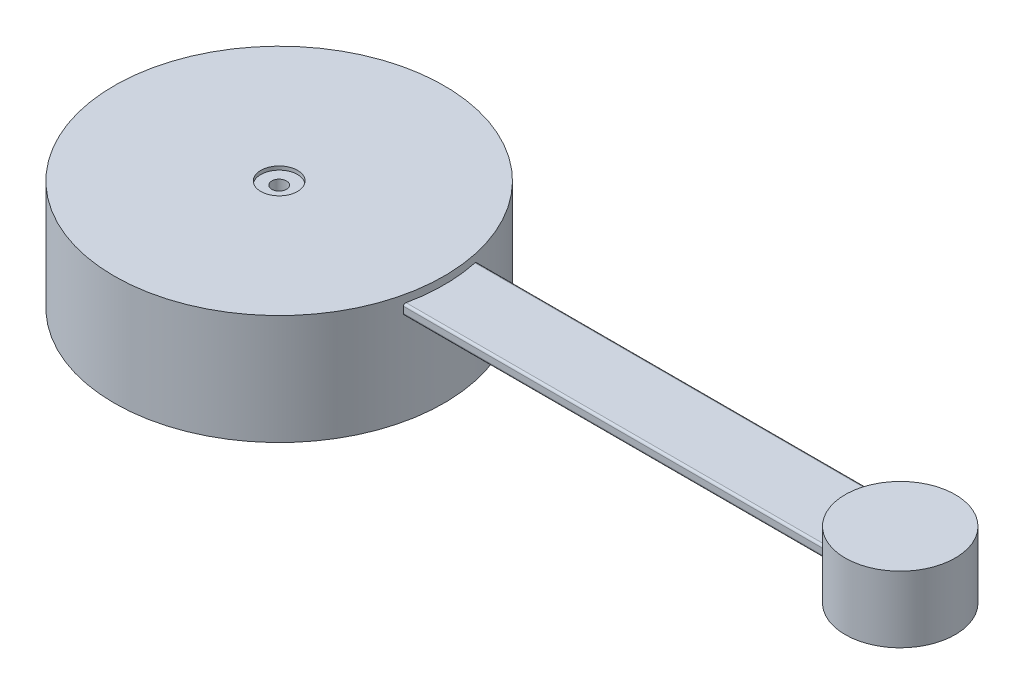
ISO-10303-21;
HEADER;
FILE_DESCRIPTION(('STEP AP214'),'2;1');
FILE_NAME('part.step','',(''),(''),'','','');
FILE_SCHEMA(('AUTOMOTIVE_DESIGN { 1 0 10303 214 1 1 1 1 }'));
ENDSEC;
DATA;
#1=APPLICATION_CONTEXT('core data for automotive mechanical design processes');
#2=APPLICATION_PROTOCOL_DEFINITION('international standard','automotive_design',2000,#1);
#3=PRODUCT_CONTEXT('',#1,'mechanical');
#4=PRODUCT('Part','Part','',(#3));
#5=PRODUCT_RELATED_PRODUCT_CATEGORY('part','',(#4));
#6=PRODUCT_DEFINITION_FORMATION('','',#4);
#7=PRODUCT_DEFINITION_CONTEXT('part definition',#1,'design');
#8=PRODUCT_DEFINITION('design','',#6,#7);
#9=PRODUCT_DEFINITION_SHAPE('','',#8);
#10=(LENGTH_UNIT() NAMED_UNIT(*) SI_UNIT(.MILLI.,.METRE.));
#11=(NAMED_UNIT(*) PLANE_ANGLE_UNIT() SI_UNIT($,.RADIAN.));
#12=(NAMED_UNIT(*) SI_UNIT($,.STERADIAN.) SOLID_ANGLE_UNIT());
#13=UNCERTAINTY_MEASURE_WITH_UNIT(LENGTH_MEASURE(1.E-05),#10,'distance_accuracy_value','');
#14=(GEOMETRIC_REPRESENTATION_CONTEXT(3) GLOBAL_UNCERTAINTY_ASSIGNED_CONTEXT((#13)) GLOBAL_UNIT_ASSIGNED_CONTEXT((#10,
#11,#12)) REPRESENTATION_CONTEXT('',''));
#15=CARTESIAN_POINT('',(0.,0.,0.));
#16=DIRECTION('',(0.,0.,1.));
#17=DIRECTION('',(1.,0.,0.));
#18=AXIS2_PLACEMENT_3D('',#15,#16,#17);
#19=CARTESIAN_POINT('',(-22.502,5.02974163039778,5.));
#20=DIRECTION('',(0.,0.,1.));
#21=DIRECTION('',(1.,0.,0.));
#22=AXIS2_PLACEMENT_3D('',#19,#20,#21);
#23=PLANE('',#22);
#24=DIRECTION('',(0.,-1.,0.));
#25=VECTOR('',#24,1.);
#26=CARTESIAN_POINT('',(21.9374109684803,7.5,5.));
#27=LINE('',#26,#25);
#28=CARTESIAN_POINT('',(21.9374109684803,6.16643646538342,5.));
#29=VERTEX_POINT('',#28);
#30=CARTESIAN_POINT('',(21.9374109684803,5.32974163039778,5.));
#31=VERTEX_POINT('',#30);
#32=EDGE_CURVE('E151',#29,#31,#27,.T.);
#33=ORIENTED_EDGE('',*,*,#32,.T.);
#34=DIRECTION('',(1.,0.,0.));
#35=VECTOR('',#34,1.);
#36=CARTESIAN_POINT('',(-22.502,5.32974163039778,5.));
#37=LINE('',#36,#35);
#38=CARTESIAN_POINT('',(79.1098300562505,5.32974163039777,5.));
#39=VERTEX_POINT('',#38);
#40=EDGE_CURVE('E122',#31,#39,#37,.T.);
#41=ORIENTED_EDGE('',*,*,#40,.T.);
#42=DIRECTION('',(0.,-1.,0.));
#43=VECTOR('',#42,1.);
#44=CARTESIAN_POINT('',(79.1098300562505,15.,5.));
#45=LINE('',#44,#43);
#46=CARTESIAN_POINT('',(79.1098300562505,6.16643646538342,5.));
#47=VERTEX_POINT('',#46);
#48=EDGE_CURVE('E139',#39,#47,#45,.F.);
#49=ORIENTED_EDGE('',*,*,#48,.T.);
#50=DIRECTION('',(1.,0.,0.));
#51=VECTOR('',#50,1.);
#52=CARTESIAN_POINT('',(-22.502,6.16643646538342,5.));
#53=LINE('',#52,#51);
#54=EDGE_CURVE('E67',#47,#29,#53,.F.);
#55=ORIENTED_EDGE('',*,*,#54,.T.);
#56=EDGE_LOOP('',(#33,#41,#49,#55));
#57=FACE_BOUND('',#56,.T.);
#58=ADVANCED_FACE('F39',(#57),#23,.T.);
#59=CARTESIAN_POINT('',(-22.502,5.02974163039778,-5.));
#60=DIRECTION('',(0.,0.,-1.));
#61=DIRECTION('',(-1.,0.,0.));
#62=AXIS2_PLACEMENT_3D('',#59,#60,#61);
#63=PLANE('',#62);
#64=DIRECTION('',(0.,-1.,0.));
#65=VECTOR('',#64,1.);
#66=CARTESIAN_POINT('',(79.1098300562505,15.,-5.));
#67=LINE('',#66,#65);
#68=CARTESIAN_POINT('',(79.1098300562505,6.16643646538343,-5.));
#69=VERTEX_POINT('',#68);
#70=CARTESIAN_POINT('',(79.1098300562505,5.32974163039778,-5.));
#71=VERTEX_POINT('',#70);
#72=EDGE_CURVE('E144',#69,#71,#67,.T.);
#73=ORIENTED_EDGE('',*,*,#72,.T.);
#74=DIRECTION('',(1.,0.,0.));
#75=VECTOR('',#74,1.);
#76=CARTESIAN_POINT('',(-22.502,5.32974163039778,-5.));
#77=LINE('',#76,#75);
#78=CARTESIAN_POINT('',(21.9374109684803,5.32974163039778,-5.));
#79=VERTEX_POINT('',#78);
#80=EDGE_CURVE('E116',#71,#79,#77,.F.);
#81=ORIENTED_EDGE('',*,*,#80,.T.);
#82=DIRECTION('',(0.,-1.,0.));
#83=VECTOR('',#82,1.);
#84=CARTESIAN_POINT('',(21.9374109684803,7.5,-5.));
#85=LINE('',#84,#83);
#86=CARTESIAN_POINT('',(21.9374109684803,6.16643646538343,-5.));
#87=VERTEX_POINT('',#86);
#88=EDGE_CURVE('E142',#79,#87,#85,.F.);
#89=ORIENTED_EDGE('',*,*,#88,.T.);
#90=DIRECTION('',(1.,0.,0.));
#91=VECTOR('',#90,1.);
#92=CARTESIAN_POINT('',(-22.502,6.16643646538343,-5.));
#93=LINE('',#92,#91);
#94=EDGE_CURVE('E131',#87,#69,#93,.T.);
#95=ORIENTED_EDGE('',*,*,#94,.T.);
#96=EDGE_LOOP('',(#73,#81,#89,#95));
#97=FACE_BOUND('',#96,.T.);
#98=ADVANCED_FACE('F242',(#97),#63,.T.);
#99=CARTESIAN_POINT('',(0.,7.5,0.));
#100=DIRECTION('',(0.,-1.,0.));
#101=DIRECTION('',(0.,0.,-1.));
#102=AXIS2_PLACEMENT_3D('',#99,#100,#101);
#103=CYLINDRICAL_SURFACE('',#102,22.5);
#104=ORIENTED_EDGE('',*,*,#88,.F.);
#105=CARTESIAN_POINT('',(21.9374109684803,5.32974163039778,-5.));
#106=CARTESIAN_POINT('',(21.937406865348,5.31316354075174,-5.00001565178497));
#107=CARTESIAN_POINT('',(21.9377239334269,5.29659236692933,-4.99862684241301));
#108=CARTESIAN_POINT('',(21.9389693939826,5.26394837265453,-4.99315891772323));
#109=CARTESIAN_POINT('',(21.9398968605122,5.24787483591722,-4.98908387728288));
#110=CARTESIAN_POINT('',(21.9423325415707,5.21665420645818,-4.97836026362395));
#111=CARTESIAN_POINT('',(21.9438408851947,5.20150732054441,-4.97171111833097));
#112=CARTESIAN_POINT('',(21.9473825394913,5.17255568574754,-4.95605329721319));
#113=CARTESIAN_POINT('',(21.94941586728,5.15875098064376,-4.94704454445796));
#114=CARTESIAN_POINT('',(21.9539634249717,5.13269924290083,-4.92682433880949));
#115=CARTESIAN_POINT('',(21.9564827917378,5.12047141281788,-4.9155893189827));
#116=CARTESIAN_POINT('',(21.9619043244392,5.09806628274106,-4.89130994192386));
#117=CARTESIAN_POINT('',(21.9648065824029,5.08788947720567,-4.87826514967078));
#118=CARTESIAN_POINT('',(21.9709750522913,5.06962392161329,-4.85040856496719));
#119=CARTESIAN_POINT('',(21.9742482291966,5.06159002849504,-4.83556237676449));
#120=CARTESIAN_POINT('',(21.981000227255,5.04813215916057,-4.80477647269883));
#121=CARTESIAN_POINT('',(21.9844789897746,5.04270744279827,-4.78883706841653));
#122=CARTESIAN_POINT('',(21.9905852037846,5.03569269865328,-4.76070477255301));
#123=CARTESIAN_POINT('',(21.9931889745046,5.03346282589828,-4.74866198788495));
#124=CARTESIAN_POINT('',(21.9984103799019,5.03048725864101,-4.7244149270426));
#125=CARTESIAN_POINT('',(22.0010279907442,5.0297395382112,-4.71221089429226));
#126=CARTESIAN_POINT('',(22.0036360631601,5.02974163039778,-4.7));
#127=B_SPLINE_CURVE_WITH_KNOTS('',3,(#105,#106,#107,#108,#109,#110,#111,#112,#113,#114,#115,
#116,#117,#118,#119,#120,#121,#122,#123,#124,#125,#126),.UNSPECIFIED.,.F.,.F.,(4,2,2,2,2,2,2,2,
2,2,4),(0.,0.0496627691444595,0.0992503751973924,0.148849008035062,0.198449258141109,
0.248605694190537,0.298774207466198,0.350124954211031,0.401461125667854,0.438939881917801,
0.476367373702138),.UNSPECIFIED.);
#128=CARTESIAN_POINT('',(22.0036360631601,5.02974163039778,-4.7));
#129=VERTEX_POINT('',#128);
#130=EDGE_CURVE('E121',#79,#129,#127,.T.);
#131=ORIENTED_EDGE('',*,*,#130,.T.);
#132=CARTESIAN_POINT('',(0.,5.02974163039778,0.));
#133=DIRECTION('',(0.,-1.,0.));
#134=DIRECTION('',(0.,0.,-1.));
#135=AXIS2_PLACEMENT_3D('',#132,#133,#134);
#136=CIRCLE('',#135,22.5);
#137=CARTESIAN_POINT('',(22.0036360631601,5.02974163039778,4.7));
#138=VERTEX_POINT('',#137);
#139=EDGE_CURVE('E130',#138,#129,#136,.F.);
#140=ORIENTED_EDGE('',*,*,#139,.F.);
#141=CARTESIAN_POINT('',(22.0036360631601,5.02974163039778,4.7));
#142=CARTESIAN_POINT('',(21.9999650754254,5.02972882581572,4.71718998797957));
#143=CARTESIAN_POINT('',(21.9962729849371,5.03121837926234,4.73437266595167));
#144=CARTESIAN_POINT('',(21.9889548978668,5.03710519846554,4.7682442421456));
#145=CARTESIAN_POINT('',(21.9853288901985,5.04150197179176,4.78493322349063));
#146=CARTESIAN_POINT('',(21.9782476781734,5.05311001549823,4.8173548017975));
#147=CARTESIAN_POINT('',(21.9747925850396,5.06032309213485,4.83308677747765));
#148=CARTESIAN_POINT('',(21.9681658331569,5.07737269398329,4.8631189473594));
#149=CARTESIAN_POINT('',(21.9649940807403,5.08720834789813,4.8774196149172));
#150=CARTESIAN_POINT('',(21.9590670953692,5.10914147554456,4.90403476586607));
#151=CARTESIAN_POINT('',(21.9563082360852,5.12121687869912,4.91636661393081));
#152=CARTESIAN_POINT('',(21.9512682996128,5.14736454949226,4.93882099270274));
#153=CARTESIAN_POINT('',(21.9489872856333,5.16143708089624,4.94894323113269));
#154=CARTESIAN_POINT('',(21.9450336634162,5.19084095598946,4.96644505930458));
#155=CARTESIAN_POINT('',(21.9433486582224,5.20613736457608,4.9738806128787));
#156=CARTESIAN_POINT('',(21.9405823846822,5.23780834566935,4.98606899680203));
#157=CARTESIAN_POINT('',(21.9395005435971,5.25418187880738,4.99082437217992));
#158=CARTESIAN_POINT('',(21.938299111856,5.28053206900157,4.99610206695527));
#159=CARTESIAN_POINT('',(21.9379663159859,5.29032074216175,4.99756296178367));
#160=CARTESIAN_POINT('',(21.9375222847446,5.30998522405526,4.99951161303384));
#161=CARTESIAN_POINT('',(21.9374107322678,5.31986088766947,5.00000076224911));
#162=CARTESIAN_POINT('',(21.9374109684803,5.32974163039771,5.00000000000034));
#163=B_SPLINE_CURVE_WITH_KNOTS('',3,(#141,#142,#143,#144,#145,#146,#147,#148,#149,#150,#151,
#152,#153,#154,#155,#156,#157,#158,#159,#160,#161,#162),.UNSPECIFIED.,.F.,.F.,(4,2,2,2,2,2,2,2,
2,2,4),(0.,0.0526662949181202,0.105323671404695,0.15801487570059,0.210688596199799,
0.26286846709763,0.315055235937837,0.366081963749873,0.417060155896441,0.446722272435618,
0.476341843791279),.UNSPECIFIED.);
#164=EDGE_CURVE('E60',#138,#31,#163,.T.);
#165=ORIENTED_EDGE('',*,*,#164,.T.);
#166=ORIENTED_EDGE('',*,*,#32,.F.);
#167=CARTESIAN_POINT('',(21.9374109684803,6.16643646538342,5.));
#168=CARTESIAN_POINT('',(21.937406865348,6.18301455502947,5.00001565178497));
#169=CARTESIAN_POINT('',(21.9377239334269,6.19958572885187,4.99862684241301));
#170=CARTESIAN_POINT('',(21.9389693939826,6.23222972312667,4.99315891772324));
#171=CARTESIAN_POINT('',(21.9398968605122,6.24830325986398,4.98908387728289));
#172=CARTESIAN_POINT('',(21.9423325415707,6.27952388932302,4.97836026362396));
#173=CARTESIAN_POINT('',(21.9438408851947,6.29467077523679,4.97171111833098));
#174=CARTESIAN_POINT('',(21.9473825394913,6.32362241003366,4.95605329721319));
#175=CARTESIAN_POINT('',(21.94941586728,6.33742711513744,4.94704454445797));
#176=CARTESIAN_POINT('',(21.9539634249717,6.36347885288038,4.92682433880949));
#177=CARTESIAN_POINT('',(21.9564827917378,6.37570668296332,4.9155893189827));
#178=CARTESIAN_POINT('',(21.9619043244392,6.39811181304014,4.89130994192386));
#179=CARTESIAN_POINT('',(21.9648065824029,6.40828861857553,4.87826514967078));
#180=CARTESIAN_POINT('',(21.9709750522913,6.42655417416791,4.85040856496719));
#181=CARTESIAN_POINT('',(21.9742482291966,6.43458806728617,4.83556237676449));
#182=CARTESIAN_POINT('',(21.981000227255,6.44804593662063,4.80477647269883));
#183=CARTESIAN_POINT('',(21.9844789897746,6.45347065298293,4.78883706841653));
#184=CARTESIAN_POINT('',(21.9905852037846,6.46048539712792,4.76070477255301));
#185=CARTESIAN_POINT('',(21.9931889745046,6.46271526988292,4.74866198788496));
#186=CARTESIAN_POINT('',(21.9984103799019,6.4656908371402,4.7244149270426));
#187=CARTESIAN_POINT('',(22.0010279907442,6.46643855757,4.71221089429226));
#188=CARTESIAN_POINT('',(22.0036360631601,6.46643646538342,4.7));
#189=B_SPLINE_CURVE_WITH_KNOTS('',3,(#167,#168,#169,#170,#171,#172,#173,#174,#175,#176,#177,
#178,#179,#180,#181,#182,#183,#184,#185,#186,#187,#188),.UNSPECIFIED.,.F.,.F.,(4,2,2,2,2,2,2,2,
2,2,4),(0.,0.0496627691444586,0.0992503751973925,0.148849008035061,0.198449258141109,
0.248605694190537,0.298774207466198,0.350124954211031,0.401461125667854,0.438939881917801,
0.476367373702139),.UNSPECIFIED.);
#190=CARTESIAN_POINT('',(22.0036360631601,6.46643646538342,4.7));
#191=VERTEX_POINT('',#190);
#192=EDGE_CURVE('E11',#29,#191,#189,.T.);
#193=ORIENTED_EDGE('',*,*,#192,.T.);
#194=CARTESIAN_POINT('',(0.,6.46643646538342,0.));
#195=DIRECTION('',(0.,1.,0.));
#196=DIRECTION('',(0.,0.,1.));
#197=AXIS2_PLACEMENT_3D('',#194,#195,#196);
#198=CIRCLE('',#197,22.5);
#199=CARTESIAN_POINT('',(22.0036360631601,6.46643646538342,-4.7));
#200=VERTEX_POINT('',#199);
#201=EDGE_CURVE('E138',#200,#191,#198,.F.);
#202=ORIENTED_EDGE('',*,*,#201,.F.);
#203=CARTESIAN_POINT('',(22.0036360631601,6.46643646538342,-4.7));
#204=CARTESIAN_POINT('',(21.9999650754254,6.46644926996548,-4.71718998797957));
#205=CARTESIAN_POINT('',(21.9962729849371,6.46495971651886,-4.73437266595167));
#206=CARTESIAN_POINT('',(21.9889548978668,6.45907289731566,-4.7682442421456));
#207=CARTESIAN_POINT('',(21.9853288901985,6.45467612398944,-4.78493322349062));
#208=CARTESIAN_POINT('',(21.9782476781734,6.44306808028296,-4.8173548017975));
#209=CARTESIAN_POINT('',(21.9747925850396,6.43585500364635,-4.83308677747765));
#210=CARTESIAN_POINT('',(21.9681658331569,6.41880540179791,-4.86311894735939));
#211=CARTESIAN_POINT('',(21.9649940807403,6.40896974788307,-4.8774196149172));
#212=CARTESIAN_POINT('',(21.9590670953692,6.38703662023664,-4.90403476586607));
#213=CARTESIAN_POINT('',(21.9563082360852,6.37496121708208,-4.91636661393081));
#214=CARTESIAN_POINT('',(21.9512682996128,6.34881354628894,-4.93882099270274));
#215=CARTESIAN_POINT('',(21.9489872856333,6.33474101488496,-4.94894323113269));
#216=CARTESIAN_POINT('',(21.9450336634162,6.30533713979174,-4.96644505930457));
#217=CARTESIAN_POINT('',(21.9433486582224,6.29004073120512,-4.9738806128787));
#218=CARTESIAN_POINT('',(21.9405823846822,6.25836975011185,-4.98606899680203));
#219=CARTESIAN_POINT('',(21.9395005435971,6.24199621697383,-4.99082437217992));
#220=CARTESIAN_POINT('',(21.938299111856,6.21564602677964,-4.99610206695527));
#221=CARTESIAN_POINT('',(21.9379663159859,6.20585735361945,-4.99756296178367));
#222=CARTESIAN_POINT('',(21.9375222847446,6.18619287172594,-4.99951161303384));
#223=CARTESIAN_POINT('',(21.9374107322678,6.17631720811173,-5.00000076224911));
#224=CARTESIAN_POINT('',(21.9374109684803,6.16643646538349,-5.00000000000034));
#225=B_SPLINE_CURVE_WITH_KNOTS('',3,(#203,#204,#205,#206,#207,#208,#209,#210,#211,#212,#213,
#214,#215,#216,#217,#218,#219,#220,#221,#222,#223,#224),.UNSPECIFIED.,.F.,.F.,(4,2,2,2,2,2,2,2,
2,2,4),(0.,0.0526662949181202,0.105323671404695,0.15801487570059,0.210688596199799,
0.26286846709763,0.315055235937837,0.366081963749873,0.417060155896441,0.446722272435617,
0.476341843791279),.UNSPECIFIED.);
#226=EDGE_CURVE('E209',#200,#87,#225,.T.);
#227=ORIENTED_EDGE('',*,*,#226,.T.);
#228=EDGE_LOOP('',(#104,#131,#140,#165,#166,#193,#202,#227));
#229=FACE_BOUND('',#228,.T.);
#230=CARTESIAN_POINT('',(0.,7.5,0.));
#231=DIRECTION('',(0.,1.,0.));
#232=DIRECTION('',(0.,0.,1.));
#233=AXIS2_PLACEMENT_3D('',#230,#231,#232);
#234=CIRCLE('',#233,22.5);
#235=CARTESIAN_POINT('',(0.,7.5,22.5));
#236=VERTEX_POINT('',#235);
#237=EDGE_CURVE('E154',#236,#236,#234,.T.);
#238=ORIENTED_EDGE('',*,*,#237,.F.);
#239=EDGE_LOOP('',(#238));
#240=FACE_BOUND('',#239,.T.);
#241=CARTESIAN_POINT('',(0.,-7.5,0.));
#242=DIRECTION('',(0.,1.,0.));
#243=DIRECTION('',(0.,0.,1.));
#244=AXIS2_PLACEMENT_3D('',#241,#242,#243);
#245=CIRCLE('',#244,22.5);
#246=CARTESIAN_POINT('',(0.,-7.5,22.5));
#247=VERTEX_POINT('',#246);
#248=EDGE_CURVE('E153',#247,#247,#245,.T.);
#249=ORIENTED_EDGE('',*,*,#248,.T.);
#250=EDGE_LOOP('',(#249));
#251=FACE_BOUND('',#250,.T.);
#252=ADVANCED_FACE('F193',(#229,#240,#251),#103,.T.);
#253=CARTESIAN_POINT('',(0.,7.5,0.));
#254=DIRECTION('',(0.,1.,0.));
#255=DIRECTION('',(0.,0.,1.));
#256=AXIS2_PLACEMENT_3D('',#253,#254,#255);
#257=PLANE('',#256);
#258=CARTESIAN_POINT('',(0.,7.5,0.));
#259=DIRECTION('',(0.,1.,0.));
#260=DIRECTION('',(0.,0.,1.));
#261=AXIS2_PLACEMENT_3D('',#258,#259,#260);
#262=CIRCLE('',#261,2.5);
#263=CARTESIAN_POINT('',(0.,7.5,2.5));
#264=VERTEX_POINT('',#263);
#265=EDGE_CURVE('E251',#264,#264,#262,.T.);
#266=ORIENTED_EDGE('',*,*,#265,.F.);
#267=EDGE_LOOP('',(#266));
#268=FACE_BOUND('',#267,.T.);
#269=ORIENTED_EDGE('',*,*,#237,.T.);
#270=EDGE_LOOP('',(#269));
#271=FACE_BOUND('',#270,.T.);
#272=ADVANCED_FACE('F283',(#268,#271),#257,.T.);
#273=CARTESIAN_POINT('',(0.,-7.5,0.));
#274=DIRECTION('',(0.,1.,0.));
#275=DIRECTION('',(0.,0.,1.));
#276=AXIS2_PLACEMENT_3D('',#273,#274,#275);
#277=PLANE('',#276);
#278=ORIENTED_EDGE('',*,*,#248,.F.);
#279=EDGE_LOOP('',(#278));
#280=FACE_BOUND('',#279,.T.);
#281=ADVANCED_FACE('F286',(#280),#277,.F.);
#282=CARTESIAN_POINT('',(-22.502,5.02974163039778,-5.));
#283=DIRECTION('',(0.,-1.,0.));
#284=DIRECTION('',(0.,0.,-1.));
#285=AXIS2_PLACEMENT_3D('',#282,#283,#284);
#286=PLANE('',#285);
#287=ORIENTED_EDGE('',*,*,#139,.T.);
#288=DIRECTION('',(1.,0.,0.));
#289=VECTOR('',#288,1.);
#290=CARTESIAN_POINT('',(-22.502,5.02974163039778,-4.7));
#291=LINE('',#290,#289);
#292=CARTESIAN_POINT('',(78.855344321519,5.02974163039778,-4.7));
#293=VERTEX_POINT('',#292);
#294=EDGE_CURVE('E115',#129,#293,#291,.T.);
#295=ORIENTED_EDGE('',*,*,#294,.T.);
#296=CARTESIAN_POINT('',(84.7,5.02974163039778,0.));
#297=DIRECTION('',(0.,-1.,0.));
#298=DIRECTION('',(0.,0.,-1.));
#299=AXIS2_PLACEMENT_3D('',#296,#297,#298);
#300=CIRCLE('',#299,7.5);
#301=CARTESIAN_POINT('',(78.855344321519,5.02974163039778,4.7));
#302=VERTEX_POINT('',#301);
#303=EDGE_CURVE('E128',#293,#302,#300,.F.);
#304=ORIENTED_EDGE('',*,*,#303,.T.);
#305=DIRECTION('',(1.,0.,0.));
#306=VECTOR('',#305,1.);
#307=CARTESIAN_POINT('',(-22.502,5.02974163039778,4.7));
#308=LINE('',#307,#306);
#309=EDGE_CURVE('E132',#302,#138,#308,.F.);
#310=ORIENTED_EDGE('',*,*,#309,.T.);
#311=EDGE_LOOP('',(#287,#295,#304,#310));
#312=FACE_BOUND('',#311,.T.);
#313=ADVANCED_FACE('F127',(#312),#286,.T.);
#314=CARTESIAN_POINT('',(-22.502,6.46643646538342,-5.));
#315=DIRECTION('',(0.,1.,0.));
#316=DIRECTION('',(0.,0.,1.));
#317=AXIS2_PLACEMENT_3D('',#314,#315,#316);
#318=PLANE('',#317);
#319=CARTESIAN_POINT('',(84.7,6.46643646538342,0.));
#320=DIRECTION('',(0.,1.,0.));
#321=DIRECTION('',(0.,0.,1.));
#322=AXIS2_PLACEMENT_3D('',#319,#320,#321);
#323=CIRCLE('',#322,7.5);
#324=CARTESIAN_POINT('',(78.855344321519,6.46643646538342,4.7));
#325=VERTEX_POINT('',#324);
#326=CARTESIAN_POINT('',(78.855344321519,6.46643646538342,-4.7));
#327=VERTEX_POINT('',#326);
#328=EDGE_CURVE('E157',#325,#327,#323,.F.);
#329=ORIENTED_EDGE('',*,*,#328,.T.);
#330=DIRECTION('',(1.,0.,0.));
#331=VECTOR('',#330,1.);
#332=CARTESIAN_POINT('',(-22.502,6.46643646538342,-4.7));
#333=LINE('',#332,#331);
#334=EDGE_CURVE('E169',#327,#200,#333,.F.);
#335=ORIENTED_EDGE('',*,*,#334,.T.);
#336=ORIENTED_EDGE('',*,*,#201,.T.);
#337=DIRECTION('',(1.,0.,0.));
#338=VECTOR('',#337,1.);
#339=CARTESIAN_POINT('',(-22.502,6.46643646538342,4.7));
#340=LINE('',#339,#338);
#341=EDGE_CURVE('E166',#191,#325,#340,.T.);
#342=ORIENTED_EDGE('',*,*,#341,.T.);
#343=EDGE_LOOP('',(#329,#335,#336,#342));
#344=FACE_BOUND('',#343,.T.);
#345=ADVANCED_FACE('F238',(#344),#318,.T.);
#346=CARTESIAN_POINT('',(84.7,15.,0.));
#347=DIRECTION('',(0.,-1.,0.));
#348=DIRECTION('',(0.,0.,-1.));
#349=AXIS2_PLACEMENT_3D('',#346,#347,#348);
#350=CYLINDRICAL_SURFACE('',#349,7.5);
#351=ORIENTED_EDGE('',*,*,#303,.F.);
#352=CARTESIAN_POINT('',(78.855344321519,5.02974163039778,-4.7));
#353=CARTESIAN_POINT('',(78.8712030380244,5.02975771418991,-4.71972827815664));
#354=CARTESIAN_POINT('',(78.8871817418711,5.03168929316465,-4.73938698076376));
#355=CARTESIAN_POINT('',(78.9190493434537,5.03942961975224,-4.77820316346192));
#356=CARTESIAN_POINT('',(78.9349371033589,5.0452618845292,-4.79735686645343));
#357=CARTESIAN_POINT('',(78.9647394939133,5.06017466709663,-4.83293726870535));
#358=CARTESIAN_POINT('',(78.9787057844008,5.06892980847668,-4.8494564351266));
#359=CARTESIAN_POINT('',(79.0056602267922,5.08980702670581,-4.88107801322704));
#360=CARTESIAN_POINT('',(79.0186505621718,5.10192128480559,-4.89618360726265));
#361=CARTESIAN_POINT('',(79.0400719003135,5.12622536803336,-4.92091594348356));
#362=CARTESIAN_POINT('',(79.0488410522481,5.13767238260289,-4.93097920390164));
#363=CARTESIAN_POINT('',(79.0651202438728,5.16254958045455,-4.94957393730758));
#364=CARTESIAN_POINT('',(79.0726316472017,5.17597758585072,-4.95810706996636));
#365=CARTESIAN_POINT('',(79.0846827510804,5.20196908846083,-4.97174810503273));
#366=CARTESIAN_POINT('',(79.0895158038967,5.21421582650445,-4.97719858701223));
#367=CARTESIAN_POINT('',(79.097781195299,5.2397344708988,-4.98650009509471));
#368=CARTESIAN_POINT('',(79.1012164716157,5.2530041567021,-4.99035447605601));
#369=CARTESIAN_POINT('',(79.1057953474714,5.27685374716861,-4.99548631091329));
#370=CARTESIAN_POINT('',(79.1072967312401,5.28727967772663,-4.99716661086003));
#371=CARTESIAN_POINT('',(79.1093194918747,5.30837978051158,-4.9994291752543));
#372=CARTESIAN_POINT('',(79.1098373965901,5.31905469806008,-5.00000754940138));
#373=CARTESIAN_POINT('',(79.1098300562505,5.32974163039778,-5.));
#374=B_SPLINE_CURVE_WITH_KNOTS('',3,(#352,#353,#354,#355,#356,#357,#358,#359,#360,#361,#362,
#363,#364,#365,#366,#367,#368,#369,#370,#371,#372,#373),.UNSPECIFIED.,.F.,.F.,(4,2,2,2,2,2,2,2,
2,2,4),(0.,0.0759020961585354,0.152265980032451,0.222010686011721,0.291594396139521,
0.34416325335823,0.396674741626252,0.439255457970424,0.481746213599653,0.513645982118855,
0.545658164169613),.UNSPECIFIED.);
#375=EDGE_CURVE('E111',#293,#71,#374,.T.);
#376=ORIENTED_EDGE('',*,*,#375,.T.);
#377=ORIENTED_EDGE('',*,*,#72,.F.);
#378=CARTESIAN_POINT('',(79.1098300562505,6.16643646538343,-5.));
#379=CARTESIAN_POINT('',(79.1098515490268,6.18038413112606,-5.00002227229002));
#380=CARTESIAN_POINT('',(79.1089614587423,6.19430016216146,-4.99902892444244));
#381=CARTESIAN_POINT('',(79.105543136355,6.22156226411405,-4.99520403860906));
#382=CARTESIAN_POINT('',(79.1030278609052,6.23491196068655,-4.99238703919308));
#383=CARTESIAN_POINT('',(79.0965468727676,6.2607357204988,-4.98511133773813));
#384=CARTESIAN_POINT('',(79.0925846686069,6.27321181557111,-4.98065660671253));
#385=CARTESIAN_POINT('',(79.0834512529185,6.29711911174589,-4.97035491849144));
#386=CARTESIAN_POINT('',(79.0782775569633,6.30854809759912,-4.9645050999042));
#387=CARTESIAN_POINT('',(79.0648905164734,6.33418699440627,-4.94931072259066));
#388=CARTESIAN_POINT('',(79.0562576379721,6.34788426748837,-4.93947063333302));
#389=CARTESIAN_POINT('',(79.0377117946888,6.37298025897817,-4.91820012675092));
#390=CARTESIAN_POINT('',(79.0277966708955,6.38437501560593,-4.90676702458031));
#391=CARTESIAN_POINT('',(79.0040512410556,6.40790118194758,-4.87919939993389));
#392=CARTESIAN_POINT('',(78.9899252544144,6.41926937427702,-4.86266916046786));
#393=CARTESIAN_POINT('',(78.9608261361511,6.43833421427353,-4.82829086861217));
#394=CARTESIAN_POINT('',(78.9458520581245,6.4460266660639,-4.81044133694207));
#395=CARTESIAN_POINT('',(78.9182289495852,6.45676538003751,-4.77718565513724));
#396=CARTESIAN_POINT('',(78.9056421355586,6.46039596976031,-4.76191225626625));
#397=CARTESIAN_POINT('',(78.8804634218893,6.4652222949457,-4.73110917153566));
#398=CARTESIAN_POINT('',(78.8678718197421,6.46642930713496,-4.71558101316321));
#399=CARTESIAN_POINT('',(78.855344321519,6.46643646538342,-4.7));
#400=B_SPLINE_CURVE_WITH_KNOTS('',3,(#378,#379,#380,#381,#382,#383,#384,#385,#386,#387,#388,
#389,#390,#391,#392,#393,#394,#395,#396,#397,#398,#399),.UNSPECIFIED.,.F.,.F.,(4,2,2,2,2,2,2,2,
2,2,4),(0.,0.0417292136515791,0.083129782297656,0.124430621878097,0.165816911255103,
0.222346693177622,0.278972928903607,0.352198544685153,0.425507549374685,0.485727750938514,
0.545667096963615),.UNSPECIFIED.);
#401=EDGE_CURVE('E203',#69,#327,#400,.T.);
#402=ORIENTED_EDGE('',*,*,#401,.T.);
#403=ORIENTED_EDGE('',*,*,#328,.F.);
#404=CARTESIAN_POINT('',(78.855344321519,6.46643646538342,4.7));
#405=CARTESIAN_POINT('',(78.8712030380244,6.46642038159129,4.71972827815664));
#406=CARTESIAN_POINT('',(78.8871817418711,6.46448880261655,4.73938698076376));
#407=CARTESIAN_POINT('',(78.9190493434537,6.45674847602896,4.77820316346192));
#408=CARTESIAN_POINT('',(78.9349371033589,6.450916211252,4.79735686645343));
#409=CARTESIAN_POINT('',(78.9647394939133,6.43600342868457,4.83293726870535));
#410=CARTESIAN_POINT('',(78.9787057844008,6.42724828730452,4.84945643512661));
#411=CARTESIAN_POINT('',(79.0056602267922,6.40637106907539,4.88107801322704));
#412=CARTESIAN_POINT('',(79.0186505621718,6.39425681097561,4.89618360726266));
#413=CARTESIAN_POINT('',(79.0400719003135,6.36995272774784,4.92091594348357));
#414=CARTESIAN_POINT('',(79.0488410522481,6.3585057131783,4.93097920390165));
#415=CARTESIAN_POINT('',(79.0651202438728,6.33362851532665,4.94957393730758));
#416=CARTESIAN_POINT('',(79.0726316472017,6.32020050993048,4.95810706996636));
#417=CARTESIAN_POINT('',(79.0846827510804,6.29420900732038,4.97174810503273));
#418=CARTESIAN_POINT('',(79.0895158038967,6.28196226927676,4.97719858701223));
#419=CARTESIAN_POINT('',(79.097781195299,6.25644362488241,4.98650009509471));
#420=CARTESIAN_POINT('',(79.1012164716156,6.24317393907911,4.99035447605601));
#421=CARTESIAN_POINT('',(79.1057953474714,6.2193243486126,4.99548631091329));
#422=CARTESIAN_POINT('',(79.1072967312402,6.20889841805458,4.99716661086003));
#423=CARTESIAN_POINT('',(79.1093194918747,6.18779831526962,4.9994291752543));
#424=CARTESIAN_POINT('',(79.1098373965901,6.17712339772112,5.00000754940138));
#425=CARTESIAN_POINT('',(79.1098300562505,6.16643646538342,5.));
#426=B_SPLINE_CURVE_WITH_KNOTS('',3,(#404,#405,#406,#407,#408,#409,#410,#411,#412,#413,#414,
#415,#416,#417,#418,#419,#420,#421,#422,#423,#424,#425),.UNSPECIFIED.,.F.,.F.,(4,2,2,2,2,2,2,2,
2,2,4),(0.,0.075902096158534,0.15226598003245,0.222010686011723,0.291594396139527,
0.344163253358236,0.396674741626247,0.439255457970418,0.481746213599647,0.513645982118853,
0.545658164169613),.UNSPECIFIED.);
#427=EDGE_CURVE('E53',#325,#47,#426,.T.);
#428=ORIENTED_EDGE('',*,*,#427,.T.);
#429=ORIENTED_EDGE('',*,*,#48,.F.);
#430=CARTESIAN_POINT('',(79.1098300562505,5.32974163039778,5.));
#431=CARTESIAN_POINT('',(79.1098515490268,5.31579396465514,5.00002227229003));
#432=CARTESIAN_POINT('',(79.1089614587423,5.30187793361974,4.99902892444244));
#433=CARTESIAN_POINT('',(79.105543136355,5.27461583166715,4.99520403860907));
#434=CARTESIAN_POINT('',(79.1030278609052,5.26126613509465,4.99238703919308));
#435=CARTESIAN_POINT('',(79.0965468727676,5.2354423752824,4.98511133773813));
#436=CARTESIAN_POINT('',(79.0925846686069,5.2229662802101,4.98065660671253));
#437=CARTESIAN_POINT('',(79.0834512529185,5.19905898403531,4.97035491849144));
#438=CARTESIAN_POINT('',(79.0782775569633,5.18762999818208,4.9645050999042));
#439=CARTESIAN_POINT('',(79.0648905164734,5.16199110137493,4.94931072259066));
#440=CARTESIAN_POINT('',(79.0562576379721,5.14829382829283,4.93947063333302));
#441=CARTESIAN_POINT('',(79.0377117946888,5.12319783680303,4.91820012675092));
#442=CARTESIAN_POINT('',(79.0277966708955,5.11180308017527,4.90676702458031));
#443=CARTESIAN_POINT('',(79.0040512410556,5.08827691383362,4.8791993999339));
#444=CARTESIAN_POINT('',(78.9899252544144,5.07690872150418,4.86266916046786));
#445=CARTESIAN_POINT('',(78.9608261361511,5.05784388150767,4.82829086861217));
#446=CARTESIAN_POINT('',(78.9458520581245,5.0501514297173,4.81044133694206));
#447=CARTESIAN_POINT('',(78.9182289495852,5.03941271574369,4.77718565513724));
#448=CARTESIAN_POINT('',(78.9056421355586,5.03578212602089,4.76191225626625));
#449=CARTESIAN_POINT('',(78.8804634218893,5.0309558008355,4.73110917153566));
#450=CARTESIAN_POINT('',(78.8678718197421,5.02974878864624,4.71558101316321));
#451=CARTESIAN_POINT('',(78.855344321519,5.02974163039778,4.7));
#452=B_SPLINE_CURVE_WITH_KNOTS('',3,(#430,#431,#432,#433,#434,#435,#436,#437,#438,#439,#440,
#441,#442,#443,#444,#445,#446,#447,#448,#449,#450,#451),.UNSPECIFIED.,.F.,.F.,(4,2,2,2,2,2,2,2,
2,2,4),(0.,0.0417292136515808,0.0831297822976561,0.12443062187809,0.165816911255104,
0.222346693177623,0.278972928903607,0.352198544685155,0.425507549374693,0.485727750938518,
0.545667096963617),.UNSPECIFIED.);
#453=EDGE_CURVE('E137',#39,#302,#452,.T.);
#454=ORIENTED_EDGE('',*,*,#453,.T.);
#455=EDGE_LOOP('',(#351,#376,#377,#402,#403,#428,#429,#454));
#456=FACE_BOUND('',#455,.T.);
#457=CARTESIAN_POINT('',(84.7,0.,0.));
#458=DIRECTION('',(0.,1.,0.));
#459=DIRECTION('',(0.,0.,1.));
#460=AXIS2_PLACEMENT_3D('',#457,#458,#459);
#461=CIRCLE('',#460,7.5);
#462=CARTESIAN_POINT('',(84.7,0.,7.5));
#463=VERTEX_POINT('',#462);
#464=EDGE_CURVE('E243',#463,#463,#461,.T.);
#465=ORIENTED_EDGE('',*,*,#464,.T.);
#466=EDGE_LOOP('',(#465));
#467=FACE_BOUND('',#466,.T.);
#468=CARTESIAN_POINT('',(84.7,9.05278108872585,0.));
#469=DIRECTION('',(0.,1.,0.));
#470=DIRECTION('',(0.,0.,1.));
#471=AXIS2_PLACEMENT_3D('',#468,#469,#470);
#472=CIRCLE('',#471,7.5);
#473=CARTESIAN_POINT('',(84.7,9.05278108872585,7.5));
#474=VERTEX_POINT('',#473);
#475=EDGE_CURVE('E245',#474,#474,#472,.T.);
#476=ORIENTED_EDGE('',*,*,#475,.F.);
#477=EDGE_LOOP('',(#476));
#478=FACE_BOUND('',#477,.T.);
#479=ADVANCED_FACE('F134',(#456,#467,#478),#350,.T.);
#480=CARTESIAN_POINT('',(84.7,0.,0.));
#481=DIRECTION('',(0.,1.,0.));
#482=DIRECTION('',(0.,0.,1.));
#483=AXIS2_PLACEMENT_3D('',#480,#481,#482);
#484=PLANE('',#483);
#485=ORIENTED_EDGE('',*,*,#464,.F.);
#486=EDGE_LOOP('',(#485));
#487=FACE_BOUND('',#486,.T.);
#488=ADVANCED_FACE('F377',(#487),#484,.F.);
#489=CARTESIAN_POINT('',(92.2,9.05278108872585,11.2404702762294));
#490=DIRECTION('',(0.,1.,0.));
#491=DIRECTION('',(0.,0.,1.));
#492=AXIS2_PLACEMENT_3D('',#489,#490,#491);
#493=PLANE('',#492);
#494=ORIENTED_EDGE('',*,*,#475,.T.);
#495=EDGE_LOOP('',(#494));
#496=FACE_BOUND('',#495,.T.);
#497=ADVANCED_FACE('F279',(#496),#493,.T.);
#498=CARTESIAN_POINT('',(0.,7.,0.));
#499=DIRECTION('',(0.,1.,0.));
#500=DIRECTION('',(0.,0.,1.));
#501=AXIS2_PLACEMENT_3D('',#498,#499,#500);
#502=CYLINDRICAL_SURFACE('',#501,2.5);
#503=CARTESIAN_POINT('',(0.,7.,0.));
#504=DIRECTION('',(0.,1.,0.));
#505=DIRECTION('',(0.,0.,1.));
#506=AXIS2_PLACEMENT_3D('',#503,#504,#505);
#507=CIRCLE('',#506,2.5);
#508=CARTESIAN_POINT('',(0.,7.,2.5));
#509=VERTEX_POINT('',#508);
#510=EDGE_CURVE('E249',#509,#509,#507,.T.);
#511=ORIENTED_EDGE('',*,*,#510,.F.);
#512=EDGE_LOOP('',(#511));
#513=FACE_BOUND('',#512,.T.);
#514=ORIENTED_EDGE('',*,*,#265,.T.);
#515=EDGE_LOOP('',(#514));
#516=FACE_BOUND('',#515,.T.);
#517=ADVANCED_FACE('F273',(#513,#516),#502,.F.);
#518=CARTESIAN_POINT('',(0.,7.,0.));
#519=DIRECTION('',(0.,1.,0.));
#520=DIRECTION('',(0.,0.,1.));
#521=AXIS2_PLACEMENT_3D('',#518,#519,#520);
#522=PLANE('',#521);
#523=CARTESIAN_POINT('',(0.,7.,0.));
#524=DIRECTION('',(0.,1.,0.));
#525=DIRECTION('',(0.,0.,1.));
#526=AXIS2_PLACEMENT_3D('',#523,#524,#525);
#527=CIRCLE('',#526,1.);
#528=CARTESIAN_POINT('',(0.,7.,1.));
#529=VERTEX_POINT('',#528);
#530=EDGE_CURVE('E257',#529,#529,#527,.T.);
#531=ORIENTED_EDGE('',*,*,#530,.F.);
#532=EDGE_LOOP('',(#531));
#533=FACE_BOUND('',#532,.T.);
#534=ORIENTED_EDGE('',*,*,#510,.T.);
#535=EDGE_LOOP('',(#534));
#536=FACE_BOUND('',#535,.T.);
#537=ADVANCED_FACE('F267',(#533,#536),#522,.T.);
#538=CARTESIAN_POINT('',(0.,4.,0.));
#539=DIRECTION('',(0.,1.,0.));
#540=DIRECTION('',(0.,0.,1.));
#541=AXIS2_PLACEMENT_3D('',#538,#539,#540);
#542=CYLINDRICAL_SURFACE('',#541,1.);
#543=CARTESIAN_POINT('',(0.,4.,0.));
#544=DIRECTION('',(0.,1.,0.));
#545=DIRECTION('',(0.,0.,1.));
#546=AXIS2_PLACEMENT_3D('',#543,#544,#545);
#547=CIRCLE('',#546,1.);
#548=CARTESIAN_POINT('',(0.,4.,1.));
#549=VERTEX_POINT('',#548);
#550=EDGE_CURVE('E254',#549,#549,#547,.T.);
#551=ORIENTED_EDGE('',*,*,#550,.F.);
#552=EDGE_LOOP('',(#551));
#553=FACE_BOUND('',#552,.T.);
#554=ORIENTED_EDGE('',*,*,#530,.T.);
#555=EDGE_LOOP('',(#554));
#556=FACE_BOUND('',#555,.T.);
#557=ADVANCED_FACE('F264',(#553,#556),#542,.F.);
#558=CARTESIAN_POINT('',(0.,4.,0.));
#559=DIRECTION('',(0.,1.,0.));
#560=DIRECTION('',(0.,0.,1.));
#561=AXIS2_PLACEMENT_3D('',#558,#559,#560);
#562=PLANE('',#561);
#563=ORIENTED_EDGE('',*,*,#550,.T.);
#564=EDGE_LOOP('',(#563));
#565=FACE_BOUND('',#564,.T.);
#566=ADVANCED_FACE('F192',(#565),#562,.T.);
#567=CARTESIAN_POINT('',(-22.502,5.32974163039778,-4.7));
#568=DIRECTION('',(1.,0.,0.));
#569=DIRECTION('',(0.,0.,-1.));
#570=AXIS2_PLACEMENT_3D('',#567,#568,#569);
#571=CYLINDRICAL_SURFACE('',#570,0.3);
#572=ORIENTED_EDGE('',*,*,#130,.F.);
#573=ORIENTED_EDGE('',*,*,#80,.F.);
#574=ORIENTED_EDGE('',*,*,#375,.F.);
#575=ORIENTED_EDGE('',*,*,#294,.F.);
#576=EDGE_LOOP('',(#572,#573,#574,#575));
#577=FACE_BOUND('',#576,.T.);
#578=ADVANCED_FACE('F114',(#577),#571,.T.);
#579=CARTESIAN_POINT('',(-22.502,6.16643646538343,-4.7));
#580=DIRECTION('',(1.,0.,0.));
#581=DIRECTION('',(0.,0.,-1.));
#582=AXIS2_PLACEMENT_3D('',#579,#580,#581);
#583=CYLINDRICAL_SURFACE('',#582,0.3);
#584=ORIENTED_EDGE('',*,*,#226,.F.);
#585=ORIENTED_EDGE('',*,*,#334,.F.);
#586=ORIENTED_EDGE('',*,*,#401,.F.);
#587=ORIENTED_EDGE('',*,*,#94,.F.);
#588=EDGE_LOOP('',(#584,#585,#586,#587));
#589=FACE_BOUND('',#588,.T.);
#590=ADVANCED_FACE('F191',(#589),#583,.T.);
#591=CARTESIAN_POINT('',(-22.502,5.32974163039778,4.7));
#592=DIRECTION('',(1.,0.,0.));
#593=DIRECTION('',(0.,0.,-1.));
#594=AXIS2_PLACEMENT_3D('',#591,#592,#593);
#595=CYLINDRICAL_SURFACE('',#594,0.3);
#596=ORIENTED_EDGE('',*,*,#164,.F.);
#597=ORIENTED_EDGE('',*,*,#309,.F.);
#598=ORIENTED_EDGE('',*,*,#453,.F.);
#599=ORIENTED_EDGE('',*,*,#40,.F.);
#600=EDGE_LOOP('',(#596,#597,#598,#599));
#601=FACE_BOUND('',#600,.T.);
#602=ADVANCED_FACE('F199',(#601),#595,.T.);
#603=CARTESIAN_POINT('',(-22.502,6.16643646538342,4.7));
#604=DIRECTION('',(1.,0.,0.));
#605=DIRECTION('',(0.,0.,-1.));
#606=AXIS2_PLACEMENT_3D('',#603,#604,#605);
#607=CYLINDRICAL_SURFACE('',#606,0.3);
#608=ORIENTED_EDGE('',*,*,#192,.F.);
#609=ORIENTED_EDGE('',*,*,#54,.F.);
#610=ORIENTED_EDGE('',*,*,#427,.F.);
#611=ORIENTED_EDGE('',*,*,#341,.F.);
#612=EDGE_LOOP('',(#608,#609,#610,#611));
#613=FACE_BOUND('',#612,.T.);
#614=ADVANCED_FACE('F41',(#613),#607,.T.);
#615=CLOSED_SHELL('',(#58,#98,#252,#272,#281,#313,#345,#479,#488,#497,#517,#537,#557,#566,#578,
#590,#602,#614));
#616=MANIFOLD_SOLID_BREP('B2',#615);
#617=ADVANCED_BREP_SHAPE_REPRESENTATION('',(#18,#616),#14);
#618=SHAPE_DEFINITION_REPRESENTATION(#9,#617);
ENDSEC;
END-ISO-10303-21;
